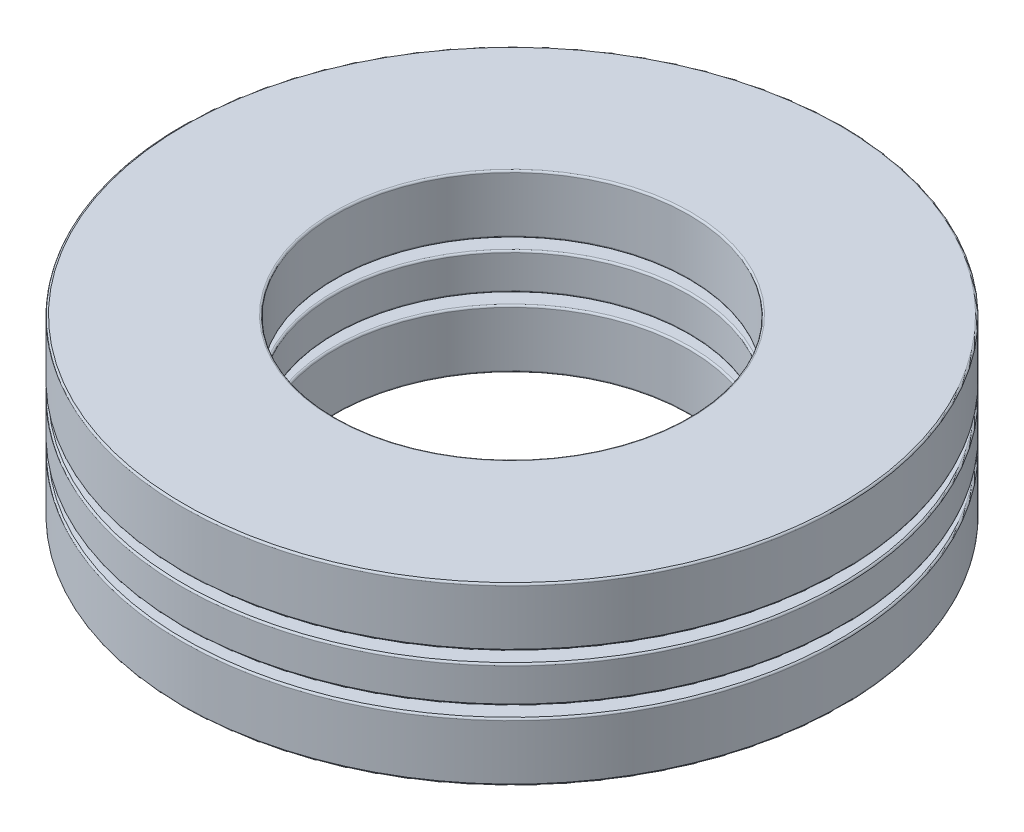
ISO-10303-21;
HEADER;
FILE_DESCRIPTION(('STEP AP214'),'2;1');
FILE_NAME('part.step','',(''),(''),'','','');
FILE_SCHEMA(('AUTOMOTIVE_DESIGN { 1 0 10303 214 1 1 1 1 }'));
ENDSEC;
DATA;
#1=APPLICATION_CONTEXT('core data for automotive mechanical design processes');
#2=APPLICATION_PROTOCOL_DEFINITION('international standard','automotive_design',2000,#1);
#3=PRODUCT_CONTEXT('',#1,'mechanical');
#4=PRODUCT('Part','Part','',(#3));
#5=PRODUCT_RELATED_PRODUCT_CATEGORY('part','',(#4));
#6=PRODUCT_DEFINITION_FORMATION('','',#4);
#7=PRODUCT_DEFINITION_CONTEXT('part definition',#1,'design');
#8=PRODUCT_DEFINITION('design','',#6,#7);
#9=PRODUCT_DEFINITION_SHAPE('','',#8);
#10=(LENGTH_UNIT() NAMED_UNIT(*) SI_UNIT(.MILLI.,.METRE.));
#11=(NAMED_UNIT(*) PLANE_ANGLE_UNIT() SI_UNIT($,.RADIAN.));
#12=(NAMED_UNIT(*) SI_UNIT($,.STERADIAN.) SOLID_ANGLE_UNIT());
#13=UNCERTAINTY_MEASURE_WITH_UNIT(LENGTH_MEASURE(1.E-05),#10,'distance_accuracy_value','');
#14=(GEOMETRIC_REPRESENTATION_CONTEXT(3) GLOBAL_UNCERTAINTY_ASSIGNED_CONTEXT((#13)) GLOBAL_UNIT_ASSIGNED_CONTEXT((#10,
#11,#12)) REPRESENTATION_CONTEXT('',''));
#15=CARTESIAN_POINT('',(0.,0.,0.));
#16=DIRECTION('',(0.,0.,1.));
#17=DIRECTION('',(1.,0.,0.));
#18=AXIS2_PLACEMENT_3D('',#15,#16,#17);
#19=CARTESIAN_POINT('',(0.,-3.1623,0.));
#20=DIRECTION('',(0.,-1.,0.));
#21=DIRECTION('',(0.,0.,-1.));
#22=AXIS2_PLACEMENT_3D('',#19,#20,#21);
#23=CYLINDRICAL_SURFACE('',#22,11.90625);
#24=CARTESIAN_POINT('',(0.,-3.099054,0.));
#25=DIRECTION('',(0.,1.,0.));
#26=DIRECTION('',(0.,0.,1.));
#27=AXIS2_PLACEMENT_3D('',#24,#25,#26);
#28=CIRCLE('',#27,11.90625);
#29=CARTESIAN_POINT('',(0.,-3.099054,11.90625));
#30=VERTEX_POINT('',#29);
#31=EDGE_CURVE('E11',#30,#30,#28,.T.);
#32=ORIENTED_EDGE('',*,*,#31,.T.);
#33=EDGE_LOOP('',(#32));
#34=FACE_BOUND('',#33,.T.);
#35=CARTESIAN_POINT('',(0.,-1.117346,0.));
#36=DIRECTION('',(0.,-1.,0.));
#37=DIRECTION('',(0.,0.,-1.));
#38=AXIS2_PLACEMENT_3D('',#35,#36,#37);
#39=CIRCLE('',#38,11.90625);
#40=CARTESIAN_POINT('',(0.,-1.117346,-11.90625));
#41=VERTEX_POINT('',#40);
#42=EDGE_CURVE('E58',#41,#41,#39,.T.);
#43=ORIENTED_EDGE('',*,*,#42,.T.);
#44=EDGE_LOOP('',(#43));
#45=FACE_BOUND('',#44,.T.);
#46=ADVANCED_FACE('F50',(#34,#45),#23,.T.);
#47=CARTESIAN_POINT('',(0.,-1.0541,11.90625));
#48=DIRECTION('',(0.,-1.,0.));
#49=DIRECTION('',(0.,0.,-1.));
#50=AXIS2_PLACEMENT_3D('',#47,#48,#49);
#51=PLANE('',#50);
#52=CARTESIAN_POINT('',(0.,-1.0541,0.));
#53=DIRECTION('',(0.,-1.,0.));
#54=DIRECTION('',(0.,0.,-1.));
#55=AXIS2_PLACEMENT_3D('',#52,#53,#54);
#56=CIRCLE('',#55,6.451346);
#57=CARTESIAN_POINT('',(0.,-1.0541,-6.451346));
#58=VERTEX_POINT('',#57);
#59=EDGE_CURVE('E63',#58,#58,#56,.T.);
#60=ORIENTED_EDGE('',*,*,#59,.T.);
#61=EDGE_LOOP('',(#60));
#62=FACE_BOUND('',#61,.T.);
#63=CARTESIAN_POINT('',(0.,-1.0541,0.));
#64=DIRECTION('',(0.,-1.,0.));
#65=DIRECTION('',(0.,0.,-1.));
#66=AXIS2_PLACEMENT_3D('',#63,#64,#65);
#67=CIRCLE('',#66,11.843004);
#68=CARTESIAN_POINT('',(0.,-1.0541,-11.843004));
#69=VERTEX_POINT('',#68);
#70=EDGE_CURVE('E68',#69,#69,#67,.F.);
#71=ORIENTED_EDGE('',*,*,#70,.T.);
#72=EDGE_LOOP('',(#71));
#73=FACE_BOUND('',#72,.T.);
#74=ADVANCED_FACE('F101',(#62,#73),#51,.F.);
#75=CARTESIAN_POINT('',(0.,-3.1623,0.));
#76=DIRECTION('',(0.,-1.,0.));
#77=DIRECTION('',(0.,0.,-1.));
#78=AXIS2_PLACEMENT_3D('',#75,#76,#77);
#79=CYLINDRICAL_SURFACE('',#78,6.3881);
#80=CARTESIAN_POINT('',(0.,-3.099054,0.));
#81=DIRECTION('',(0.,1.,0.));
#82=DIRECTION('',(0.,0.,1.));
#83=AXIS2_PLACEMENT_3D('',#80,#81,#82);
#84=CIRCLE('',#83,6.3881);
#85=CARTESIAN_POINT('',(0.,-3.099054,6.3881));
#86=VERTEX_POINT('',#85);
#87=EDGE_CURVE('E82',#86,#86,#84,.F.);
#88=ORIENTED_EDGE('',*,*,#87,.T.);
#89=EDGE_LOOP('',(#88));
#90=FACE_BOUND('',#89,.T.);
#91=CARTESIAN_POINT('',(0.,-1.117346,0.));
#92=DIRECTION('',(0.,-1.,0.));
#93=DIRECTION('',(0.,0.,-1.));
#94=AXIS2_PLACEMENT_3D('',#91,#92,#93);
#95=CIRCLE('',#94,6.3881);
#96=CARTESIAN_POINT('',(0.,-1.117346,-6.3881));
#97=VERTEX_POINT('',#96);
#98=EDGE_CURVE('E86',#97,#97,#95,.F.);
#99=ORIENTED_EDGE('',*,*,#98,.T.);
#100=EDGE_LOOP('',(#99));
#101=FACE_BOUND('',#100,.T.);
#102=ADVANCED_FACE('F91',(#90,#101),#79,.F.);
#103=CARTESIAN_POINT('',(0.,-3.1623,11.90625));
#104=DIRECTION('',(0.,1.,0.));
#105=DIRECTION('',(0.,0.,1.));
#106=AXIS2_PLACEMENT_3D('',#103,#104,#105);
#107=PLANE('',#106);
#108=CARTESIAN_POINT('',(0.,-3.1623,0.));
#109=DIRECTION('',(0.,1.,0.));
#110=DIRECTION('',(0.,0.,1.));
#111=AXIS2_PLACEMENT_3D('',#108,#109,#110);
#112=CIRCLE('',#111,6.451346);
#113=CARTESIAN_POINT('',(0.,-3.1623,6.451346));
#114=VERTEX_POINT('',#113);
#115=EDGE_CURVE('E74',#114,#114,#112,.T.);
#116=ORIENTED_EDGE('',*,*,#115,.T.);
#117=EDGE_LOOP('',(#116));
#118=FACE_BOUND('',#117,.T.);
#119=CARTESIAN_POINT('',(0.,-3.1623,0.));
#120=DIRECTION('',(0.,1.,0.));
#121=DIRECTION('',(0.,0.,1.));
#122=AXIS2_PLACEMENT_3D('',#119,#120,#121);
#123=CIRCLE('',#122,11.843004);
#124=CARTESIAN_POINT('',(0.,-3.1623,11.843004));
#125=VERTEX_POINT('',#124);
#126=EDGE_CURVE('E78',#125,#125,#123,.F.);
#127=ORIENTED_EDGE('',*,*,#126,.T.);
#128=EDGE_LOOP('',(#127));
#129=FACE_BOUND('',#128,.T.);
#130=ADVANCED_FACE('F120',(#118,#129),#107,.F.);
#131=CARTESIAN_POINT('',(0.,-3.099054,0.));
#132=DIRECTION('',(0.,1.,0.));
#133=DIRECTION('',(0.,0.,1.));
#134=AXIS2_PLACEMENT_3D('',#131,#132,#133);
#135=TOROIDAL_SURFACE('',#134,6.451346,0.063246);
#136=ORIENTED_EDGE('',*,*,#115,.F.);
#137=EDGE_LOOP('',(#136));
#138=FACE_BOUND('',#137,.T.);
#139=ORIENTED_EDGE('',*,*,#87,.F.);
#140=EDGE_LOOP('',(#139));
#141=FACE_BOUND('',#140,.T.);
#142=ADVANCED_FACE('F97',(#138,#141),#135,.T.);
#143=CARTESIAN_POINT('',(0.,-1.117346,0.));
#144=DIRECTION('',(0.,-1.,0.));
#145=DIRECTION('',(0.,0.,-1.));
#146=AXIS2_PLACEMENT_3D('',#143,#144,#145);
#147=TOROIDAL_SURFACE('',#146,6.451346,0.063246);
#148=ORIENTED_EDGE('',*,*,#98,.F.);
#149=EDGE_LOOP('',(#148));
#150=FACE_BOUND('',#149,.T.);
#151=ORIENTED_EDGE('',*,*,#59,.F.);
#152=EDGE_LOOP('',(#151));
#153=FACE_BOUND('',#152,.T.);
#154=ADVANCED_FACE('F93',(#150,#153),#147,.T.);
#155=CARTESIAN_POINT('',(0.,-3.099054,0.));
#156=DIRECTION('',(0.,1.,0.));
#157=DIRECTION('',(0.,0.,1.));
#158=AXIS2_PLACEMENT_3D('',#155,#156,#157);
#159=TOROIDAL_SURFACE('',#158,11.843004,0.063246);
#160=ORIENTED_EDGE('',*,*,#31,.F.);
#161=EDGE_LOOP('',(#160));
#162=FACE_BOUND('',#161,.T.);
#163=ORIENTED_EDGE('',*,*,#126,.F.);
#164=EDGE_LOOP('',(#163));
#165=FACE_BOUND('',#164,.T.);
#166=ADVANCED_FACE('F96',(#162,#165),#159,.T.);
#167=CARTESIAN_POINT('',(0.,-1.117346,0.));
#168=DIRECTION('',(0.,-1.,0.));
#169=DIRECTION('',(0.,0.,-1.));
#170=AXIS2_PLACEMENT_3D('',#167,#168,#169);
#171=TOROIDAL_SURFACE('',#170,11.843004,0.063246);
#172=ORIENTED_EDGE('',*,*,#70,.F.);
#173=EDGE_LOOP('',(#172));
#174=FACE_BOUND('',#173,.T.);
#175=ORIENTED_EDGE('',*,*,#42,.F.);
#176=EDGE_LOOP('',(#175));
#177=FACE_BOUND('',#176,.T.);
#178=ADVANCED_FACE('F52',(#174,#177),#171,.T.);
#179=CLOSED_SHELL('',(#46,#74,#102,#130,#142,#154,#166,#178));
#180=MANIFOLD_SOLID_BREP('B2',#179);
#181=CARTESIAN_POINT('',(0.,-3.1623,0.));
#182=DIRECTION('',(0.,-1.,0.));
#183=DIRECTION('',(0.,0.,-1.));
#184=AXIS2_PLACEMENT_3D('',#181,#182,#183);
#185=CYLINDRICAL_SURFACE('',#184,11.90625);
#186=CARTESIAN_POINT('',(0.,1.117346,0.));
#187=DIRECTION('',(0.,1.,0.));
#188=DIRECTION('',(0.,0.,1.));
#189=AXIS2_PLACEMENT_3D('',#186,#187,#188);
#190=CIRCLE('',#189,11.90625);
#191=CARTESIAN_POINT('',(0.,1.117346,11.90625));
#192=VERTEX_POINT('',#191);
#193=EDGE_CURVE('E49',#192,#192,#190,.T.);
#194=ORIENTED_EDGE('',*,*,#193,.T.);
#195=EDGE_LOOP('',(#194));
#196=FACE_BOUND('',#195,.T.);
#197=CARTESIAN_POINT('',(0.,3.099054,0.));
#198=DIRECTION('',(0.,-1.,0.));
#199=DIRECTION('',(0.,0.,-1.));
#200=AXIS2_PLACEMENT_3D('',#197,#198,#199);
#201=CIRCLE('',#200,11.90625);
#202=CARTESIAN_POINT('',(0.,3.099054,-11.90625));
#203=VERTEX_POINT('',#202);
#204=EDGE_CURVE('E177',#203,#203,#201,.T.);
#205=ORIENTED_EDGE('',*,*,#204,.T.);
#206=EDGE_LOOP('',(#205));
#207=FACE_BOUND('',#206,.T.);
#208=ADVANCED_FACE('F170',(#196,#207),#185,.T.);
#209=CARTESIAN_POINT('',(0.,3.1623,11.90625));
#210=DIRECTION('',(0.,-1.,0.));
#211=DIRECTION('',(0.,0.,-1.));
#212=AXIS2_PLACEMENT_3D('',#209,#210,#211);
#213=PLANE('',#212);
#214=CARTESIAN_POINT('',(0.,3.1623,0.));
#215=DIRECTION('',(0.,-1.,0.));
#216=DIRECTION('',(0.,0.,-1.));
#217=AXIS2_PLACEMENT_3D('',#214,#215,#216);
#218=CIRCLE('',#217,6.451346);
#219=CARTESIAN_POINT('',(0.,3.1623,-6.451346));
#220=VERTEX_POINT('',#219);
#221=EDGE_CURVE('E181',#220,#220,#218,.T.);
#222=ORIENTED_EDGE('',*,*,#221,.T.);
#223=EDGE_LOOP('',(#222));
#224=FACE_BOUND('',#223,.T.);
#225=CARTESIAN_POINT('',(0.,3.1623,0.));
#226=DIRECTION('',(0.,-1.,0.));
#227=DIRECTION('',(0.,0.,-1.));
#228=AXIS2_PLACEMENT_3D('',#225,#226,#227);
#229=CIRCLE('',#228,11.843004);
#230=CARTESIAN_POINT('',(0.,3.1623,-11.843004));
#231=VERTEX_POINT('',#230);
#232=EDGE_CURVE('E185',#231,#231,#229,.F.);
#233=ORIENTED_EDGE('',*,*,#232,.T.);
#234=EDGE_LOOP('',(#233));
#235=FACE_BOUND('',#234,.T.);
#236=ADVANCED_FACE('F213',(#224,#235),#213,.F.);
#237=CARTESIAN_POINT('',(0.,-3.1623,0.));
#238=DIRECTION('',(0.,-1.,0.));
#239=DIRECTION('',(0.,0.,-1.));
#240=AXIS2_PLACEMENT_3D('',#237,#238,#239);
#241=CYLINDRICAL_SURFACE('',#240,6.3881);
#242=CARTESIAN_POINT('',(0.,1.117346,0.));
#243=DIRECTION('',(0.,1.,0.));
#244=DIRECTION('',(0.,0.,1.));
#245=AXIS2_PLACEMENT_3D('',#242,#243,#244);
#246=CIRCLE('',#245,6.3881);
#247=CARTESIAN_POINT('',(0.,1.117346,6.3881));
#248=VERTEX_POINT('',#247);
#249=EDGE_CURVE('E196',#248,#248,#246,.F.);
#250=ORIENTED_EDGE('',*,*,#249,.T.);
#251=EDGE_LOOP('',(#250));
#252=FACE_BOUND('',#251,.T.);
#253=CARTESIAN_POINT('',(0.,3.099054,0.));
#254=DIRECTION('',(0.,-1.,0.));
#255=DIRECTION('',(0.,0.,-1.));
#256=AXIS2_PLACEMENT_3D('',#253,#254,#255);
#257=CIRCLE('',#256,6.3881);
#258=CARTESIAN_POINT('',(0.,3.099054,-6.3881));
#259=VERTEX_POINT('',#258);
#260=EDGE_CURVE('E199',#259,#259,#257,.F.);
#261=ORIENTED_EDGE('',*,*,#260,.T.);
#262=EDGE_LOOP('',(#261));
#263=FACE_BOUND('',#262,.T.);
#264=ADVANCED_FACE('F203',(#252,#263),#241,.F.);
#265=CARTESIAN_POINT('',(0.,1.0541,11.90625));
#266=DIRECTION('',(0.,1.,0.));
#267=DIRECTION('',(0.,0.,1.));
#268=AXIS2_PLACEMENT_3D('',#265,#266,#267);
#269=PLANE('',#268);
#270=CARTESIAN_POINT('',(0.,1.0541,0.));
#271=DIRECTION('',(0.,1.,0.));
#272=DIRECTION('',(0.,0.,1.));
#273=AXIS2_PLACEMENT_3D('',#270,#271,#272);
#274=CIRCLE('',#273,6.451346);
#275=CARTESIAN_POINT('',(0.,1.0541,6.451346));
#276=VERTEX_POINT('',#275);
#277=EDGE_CURVE('E190',#276,#276,#274,.T.);
#278=ORIENTED_EDGE('',*,*,#277,.T.);
#279=EDGE_LOOP('',(#278));
#280=FACE_BOUND('',#279,.T.);
#281=CARTESIAN_POINT('',(0.,1.0541,0.));
#282=DIRECTION('',(0.,1.,0.));
#283=DIRECTION('',(0.,0.,1.));
#284=AXIS2_PLACEMENT_3D('',#281,#282,#283);
#285=CIRCLE('',#284,11.843004);
#286=CARTESIAN_POINT('',(0.,1.0541,11.843004));
#287=VERTEX_POINT('',#286);
#288=EDGE_CURVE('E193',#287,#287,#285,.F.);
#289=ORIENTED_EDGE('',*,*,#288,.T.);
#290=EDGE_LOOP('',(#289));
#291=FACE_BOUND('',#290,.T.);
#292=ADVANCED_FACE('F232',(#280,#291),#269,.F.);
#293=CARTESIAN_POINT('',(0.,1.117346,0.));
#294=DIRECTION('',(0.,1.,0.));
#295=DIRECTION('',(0.,0.,1.));
#296=AXIS2_PLACEMENT_3D('',#293,#294,#295);
#297=TOROIDAL_SURFACE('',#296,6.451346,0.063246);
#298=ORIENTED_EDGE('',*,*,#277,.F.);
#299=EDGE_LOOP('',(#298));
#300=FACE_BOUND('',#299,.T.);
#301=ORIENTED_EDGE('',*,*,#249,.F.);
#302=EDGE_LOOP('',(#301));
#303=FACE_BOUND('',#302,.T.);
#304=ADVANCED_FACE('F209',(#300,#303),#297,.T.);
#305=CARTESIAN_POINT('',(0.,3.099054,0.));
#306=DIRECTION('',(0.,-1.,0.));
#307=DIRECTION('',(0.,0.,-1.));
#308=AXIS2_PLACEMENT_3D('',#305,#306,#307);
#309=TOROIDAL_SURFACE('',#308,6.451346,0.063246);
#310=ORIENTED_EDGE('',*,*,#260,.F.);
#311=EDGE_LOOP('',(#310));
#312=FACE_BOUND('',#311,.T.);
#313=ORIENTED_EDGE('',*,*,#221,.F.);
#314=EDGE_LOOP('',(#313));
#315=FACE_BOUND('',#314,.T.);
#316=ADVANCED_FACE('F205',(#312,#315),#309,.T.);
#317=CARTESIAN_POINT('',(0.,1.117346,0.));
#318=DIRECTION('',(0.,1.,0.));
#319=DIRECTION('',(0.,0.,1.));
#320=AXIS2_PLACEMENT_3D('',#317,#318,#319);
#321=TOROIDAL_SURFACE('',#320,11.843004,0.063246);
#322=ORIENTED_EDGE('',*,*,#193,.F.);
#323=EDGE_LOOP('',(#322));
#324=FACE_BOUND('',#323,.T.);
#325=ORIENTED_EDGE('',*,*,#288,.F.);
#326=EDGE_LOOP('',(#325));
#327=FACE_BOUND('',#326,.T.);
#328=ADVANCED_FACE('F208',(#324,#327),#321,.T.);
#329=CARTESIAN_POINT('',(0.,3.099054,0.));
#330=DIRECTION('',(0.,-1.,0.));
#331=DIRECTION('',(0.,0.,-1.));
#332=AXIS2_PLACEMENT_3D('',#329,#330,#331);
#333=TOROIDAL_SURFACE('',#332,11.843004,0.063246);
#334=ORIENTED_EDGE('',*,*,#232,.F.);
#335=EDGE_LOOP('',(#334));
#336=FACE_BOUND('',#335,.T.);
#337=ORIENTED_EDGE('',*,*,#204,.F.);
#338=EDGE_LOOP('',(#337));
#339=FACE_BOUND('',#338,.T.);
#340=ADVANCED_FACE('F172',(#336,#339),#333,.T.);
#341=CLOSED_SHELL('',(#208,#236,#264,#292,#304,#316,#328,#340));
#342=MANIFOLD_SOLID_BREP('B6',#341);
#343=CARTESIAN_POINT('',(-8.69948038944209,0.,2.82663252552176));
#344=DIRECTION('',(0.,1.,0.));
#345=DIRECTION('',(0.95105651629515,0.,-0.309016994374958));
#346=AXIS2_PLACEMENT_3D('',#343,#344,#345);
#347=SPHERICAL_SURFACE('',#346,1.0541);
#348=CARTESIAN_POINT('',(-8.69948038944209,1.0541,2.82663252552176));
#349=VERTEX_POINT('',#348);
#350=VERTEX_LOOP('',#349);
#351=FACE_BOUND('',#350,.T.);
#352=ADVANCED_FACE('F282',(#351),#347,.T.);
#353=CLOSED_SHELL('',(#352));
#354=MANIFOLD_SOLID_BREP('B44',#353);
#355=CARTESIAN_POINT('',(-5.37657456513847,0.,-7.40022002552161));
#356=DIRECTION('',(0.,1.,0.));
#357=DIRECTION('',(0.58778525229248,0.,0.809016994374942));
#358=AXIS2_PLACEMENT_3D('',#355,#356,#357);
#359=SPHERICAL_SURFACE('',#358,1.0541);
#360=CARTESIAN_POINT('',(-5.37657456513847,1.0541,-7.40022002552161));
#361=VERTEX_POINT('',#360);
#362=VERTEX_LOOP('',#361);
#363=FACE_BOUND('',#362,.T.);
#364=ADVANCED_FACE('F299',(#363),#359,.T.);
#365=CLOSED_SHELL('',(#364));
#366=MANIFOLD_SOLID_BREP('B166',#365);
#367=CARTESIAN_POINT('',(5.37657456513836,0.,-7.40022002552169));
#368=DIRECTION('',(0.,1.,0.));
#369=DIRECTION('',(-0.587785252292469,0.,0.809016994374951));
#370=AXIS2_PLACEMENT_3D('',#367,#368,#369);
#371=SPHERICAL_SURFACE('',#370,1.0541);
#372=CARTESIAN_POINT('',(5.37657456513836,1.0541,-7.40022002552169));
#373=VERTEX_POINT('',#372);
#374=VERTEX_LOOP('',#373);
#375=FACE_BOUND('',#374,.T.);
#376=ADVANCED_FACE('F316',(#375),#371,.T.);
#377=CLOSED_SHELL('',(#376));
#378=MANIFOLD_SOLID_BREP('B278',#377);
#379=CARTESIAN_POINT('',(8.69948038944213,0.,2.82663252552164));
#380=DIRECTION('',(0.,1.,0.));
#381=DIRECTION('',(-0.951056516295155,0.,-0.309016994374945));
#382=AXIS2_PLACEMENT_3D('',#379,#380,#381);
#383=SPHERICAL_SURFACE('',#382,1.0541);
#384=CARTESIAN_POINT('',(8.69948038944213,1.0541,2.82663252552164));
#385=VERTEX_POINT('',#384);
#386=VERTEX_LOOP('',#385);
#387=FACE_BOUND('',#386,.T.);
#388=ADVANCED_FACE('F333',(#387),#383,.T.);
#389=CLOSED_SHELL('',(#388));
#390=MANIFOLD_SOLID_BREP('B295',#389);
#391=CARTESIAN_POINT('',(0.,0.,9.147175));
#392=DIRECTION('',(0.,1.,0.));
#393=DIRECTION('',(0.,0.,-1.));
#394=AXIS2_PLACEMENT_3D('',#391,#392,#393);
#395=SPHERICAL_SURFACE('',#394,1.0541);
#396=CARTESIAN_POINT('',(0.,1.0541,9.147175));
#397=VERTEX_POINT('',#396);
#398=VERTEX_LOOP('',#397);
#399=FACE_BOUND('',#398,.T.);
#400=ADVANCED_FACE('F351',(#399),#395,.T.);
#401=CLOSED_SHELL('',(#400));
#402=MANIFOLD_SOLID_BREP('B312',#401);
#403=CARTESIAN_POINT('',(0.,-3.1623,0.));
#404=DIRECTION('',(0.,-1.,0.));
#405=DIRECTION('',(0.,0.,-1.));
#406=AXIS2_PLACEMENT_3D('',#403,#404,#405);
#407=CYLINDRICAL_SURFACE('',#406,11.90625);
#408=CARTESIAN_POINT('',(0.,-0.595566500000002,0.));
#409=DIRECTION('',(0.,1.,0.));
#410=DIRECTION('',(0.,0.,1.));
#411=AXIS2_PLACEMENT_3D('',#408,#409,#410);
#412=CIRCLE('',#411,11.90625);
#413=CARTESIAN_POINT('',(0.,-0.595566500000002,11.90625));
#414=VERTEX_POINT('',#413);
#415=EDGE_CURVE('E350',#414,#414,#412,.T.);
#416=ORIENTED_EDGE('',*,*,#415,.T.);
#417=EDGE_LOOP('',(#416));
#418=FACE_BOUND('',#417,.T.);
#419=CARTESIAN_POINT('',(0.,0.595566499999998,0.));
#420=DIRECTION('',(0.,-1.,0.));
#421=DIRECTION('',(0.,0.,-1.));
#422=AXIS2_PLACEMENT_3D('',#419,#420,#421);
#423=CIRCLE('',#422,11.90625);
#424=CARTESIAN_POINT('',(0.,0.595566499999998,-11.90625));
#425=VERTEX_POINT('',#424);
#426=EDGE_CURVE('E369',#425,#425,#423,.T.);
#427=ORIENTED_EDGE('',*,*,#426,.T.);
#428=EDGE_LOOP('',(#427));
#429=FACE_BOUND('',#428,.T.);
#430=ADVANCED_FACE('F362',(#418,#429),#407,.T.);
#431=CARTESIAN_POINT('',(0.,-0.658812500000002,11.90625));
#432=DIRECTION('',(0.,1.,0.));
#433=DIRECTION('',(0.,0.,1.));
#434=AXIS2_PLACEMENT_3D('',#431,#432,#433);
#435=PLANE('',#434);
#436=CARTESIAN_POINT('',(0.,-0.658812500000002,0.));
#437=DIRECTION('',(0.,1.,0.));
#438=DIRECTION('',(0.,0.,1.));
#439=AXIS2_PLACEMENT_3D('',#436,#437,#438);
#440=CIRCLE('',#439,6.451346);
#441=CARTESIAN_POINT('',(0.,-0.658812500000002,6.451346));
#442=VERTEX_POINT('',#441);
#443=EDGE_CURVE('E382',#442,#442,#440,.T.);
#444=ORIENTED_EDGE('',*,*,#443,.T.);
#445=EDGE_LOOP('',(#444));
#446=FACE_BOUND('',#445,.T.);
#447=CARTESIAN_POINT('',(0.,-0.658812500000002,0.));
#448=DIRECTION('',(0.,1.,0.));
#449=DIRECTION('',(0.,0.,1.));
#450=AXIS2_PLACEMENT_3D('',#447,#448,#449);
#451=CIRCLE('',#450,11.843004);
#452=CARTESIAN_POINT('',(0.,-0.658812500000002,11.843004));
#453=VERTEX_POINT('',#452);
#454=EDGE_CURVE('E385',#453,#453,#451,.F.);
#455=ORIENTED_EDGE('',*,*,#454,.T.);
#456=EDGE_LOOP('',(#455));
#457=FACE_BOUND('',#456,.T.);
#458=CARTESIAN_POINT('',(-8.69948038944209,-0.658812500000002,2.82663252552176));
#459=DIRECTION('',(0.,1.,0.));
#460=DIRECTION('',(-0.95105651629515,0.,0.309016994374958));
#461=AXIS2_PLACEMENT_3D('',#458,#459,#460);
#462=CIRCLE('',#461,0.822856548763967);
#463=CARTESIAN_POINT('',(-9.4820634721202,-0.658812500000002,3.08090918302255));
#464=VERTEX_POINT('',#463);
#465=EDGE_CURVE('E418',#464,#464,#462,.T.);
#466=ORIENTED_EDGE('',*,*,#465,.T.);
#467=EDGE_LOOP('',(#466));
#468=FACE_BOUND('',#467,.T.);
#469=CARTESIAN_POINT('',(-5.37657456513847,-0.658812500000002,-7.40022002552161));
#470=DIRECTION('',(0.,1.,0.));
#471=DIRECTION('',(-0.58778525229248,0.,-0.809016994374942));
#472=AXIS2_PLACEMENT_3D('',#469,#470,#471);
#473=CIRCLE('',#472,0.822856548763967);
#474=CARTESIAN_POINT('',(-5.86023750925422,-0.658812500000002,-8.06592495740438));
#475=VERTEX_POINT('',#474);
#476=EDGE_CURVE('E412',#475,#475,#473,.T.);
#477=ORIENTED_EDGE('',*,*,#476,.T.);
#478=EDGE_LOOP('',(#477));
#479=FACE_BOUND('',#478,.T.);
#480=CARTESIAN_POINT('',(5.37657456513836,-0.658812500000002,-7.40022002552169));
#481=DIRECTION('',(0.,1.,0.));
#482=DIRECTION('',(0.587785252292469,0.,-0.809016994374951));
#483=AXIS2_PLACEMENT_3D('',#480,#481,#482);
#484=CIRCLE('',#483,0.822856548763967);
#485=CARTESIAN_POINT('',(5.8602375092541,-0.658812500000002,-8.06592495740446));
#486=VERTEX_POINT('',#485);
#487=EDGE_CURVE('E406',#486,#486,#484,.T.);
#488=ORIENTED_EDGE('',*,*,#487,.T.);
#489=EDGE_LOOP('',(#488));
#490=FACE_BOUND('',#489,.T.);
#491=CARTESIAN_POINT('',(8.69948038944213,-0.658812500000002,2.82663252552164));
#492=DIRECTION('',(0.,1.,0.));
#493=DIRECTION('',(0.951056516295155,0.,0.309016994374945));
#494=AXIS2_PLACEMENT_3D('',#491,#492,#493);
#495=CIRCLE('',#494,0.822856548763967);
#496=CARTESIAN_POINT('',(9.48206347212025,-0.658812500000002,3.08090918302242));
#497=VERTEX_POINT('',#496);
#498=EDGE_CURVE('E398',#497,#497,#495,.T.);
#499=ORIENTED_EDGE('',*,*,#498,.T.);
#500=EDGE_LOOP('',(#499));
#501=FACE_BOUND('',#500,.T.);
#502=CARTESIAN_POINT('',(0.,-0.658812500000002,9.147175));
#503=DIRECTION('',(0.,1.,0.));
#504=DIRECTION('',(0.,0.,1.));
#505=AXIS2_PLACEMENT_3D('',#502,#503,#504);
#506=CIRCLE('',#505,0.822856548763967);
#507=CARTESIAN_POINT('',(0.,-0.658812500000002,9.97003154876397));
#508=VERTEX_POINT('',#507);
#509=EDGE_CURVE('E394',#508,#508,#506,.T.);
#510=ORIENTED_EDGE('',*,*,#509,.T.);
#511=EDGE_LOOP('',(#510));
#512=FACE_BOUND('',#511,.T.);
#513=ADVANCED_FACE('F436',(#446,#457,#468,#479,#490,#501,#512),#435,.F.);
#514=CARTESIAN_POINT('',(0.,-3.1623,0.));
#515=DIRECTION('',(0.,-1.,0.));
#516=DIRECTION('',(0.,0.,-1.));
#517=AXIS2_PLACEMENT_3D('',#514,#515,#516);
#518=CYLINDRICAL_SURFACE('',#517,6.3881);
#519=CARTESIAN_POINT('',(0.,-0.595566500000002,0.));
#520=DIRECTION('',(0.,1.,0.));
#521=DIRECTION('',(0.,0.,1.));
#522=AXIS2_PLACEMENT_3D('',#519,#520,#521);
#523=CIRCLE('',#522,6.3881);
#524=CARTESIAN_POINT('',(0.,-0.595566500000002,6.3881));
#525=VERTEX_POINT('',#524);
#526=EDGE_CURVE('E388',#525,#525,#523,.F.);
#527=ORIENTED_EDGE('',*,*,#526,.T.);
#528=EDGE_LOOP('',(#527));
#529=FACE_BOUND('',#528,.T.);
#530=CARTESIAN_POINT('',(0.,0.595566499999998,0.));
#531=DIRECTION('',(0.,-1.,0.));
#532=DIRECTION('',(0.,0.,-1.));
#533=AXIS2_PLACEMENT_3D('',#530,#531,#532);
#534=CIRCLE('',#533,6.3881);
#535=CARTESIAN_POINT('',(0.,0.595566499999998,-6.3881));
#536=VERTEX_POINT('',#535);
#537=EDGE_CURVE('E391',#536,#536,#534,.F.);
#538=ORIENTED_EDGE('',*,*,#537,.T.);
#539=EDGE_LOOP('',(#538));
#540=FACE_BOUND('',#539,.T.);
#541=ADVANCED_FACE('F439',(#529,#540),#518,.F.);
#542=CARTESIAN_POINT('',(0.,0.658812499999997,11.90625));
#543=DIRECTION('',(0.,-1.,0.));
#544=DIRECTION('',(0.,0.,-1.));
#545=AXIS2_PLACEMENT_3D('',#542,#543,#544);
#546=PLANE('',#545);
#547=CARTESIAN_POINT('',(0.,0.658812499999997,0.));
#548=DIRECTION('',(0.,-1.,0.));
#549=DIRECTION('',(0.,0.,-1.));
#550=AXIS2_PLACEMENT_3D('',#547,#548,#549);
#551=CIRCLE('',#550,6.451346);
#552=CARTESIAN_POINT('',(0.,0.658812499999997,-6.451346));
#553=VERTEX_POINT('',#552);
#554=EDGE_CURVE('E373',#553,#553,#551,.T.);
#555=ORIENTED_EDGE('',*,*,#554,.T.);
#556=EDGE_LOOP('',(#555));
#557=FACE_BOUND('',#556,.T.);
#558=CARTESIAN_POINT('',(0.,0.658812499999997,0.));
#559=DIRECTION('',(0.,-1.,0.));
#560=DIRECTION('',(0.,0.,-1.));
#561=AXIS2_PLACEMENT_3D('',#558,#559,#560);
#562=CIRCLE('',#561,11.843004);
#563=CARTESIAN_POINT('',(0.,0.658812499999997,-11.843004));
#564=VERTEX_POINT('',#563);
#565=EDGE_CURVE('E377',#564,#564,#562,.F.);
#566=ORIENTED_EDGE('',*,*,#565,.T.);
#567=EDGE_LOOP('',(#566));
#568=FACE_BOUND('',#567,.T.);
#569=CARTESIAN_POINT('',(-8.69948038944209,0.658812499999997,2.82663252552176));
#570=DIRECTION('',(0.,-1.,0.));
#571=DIRECTION('',(0.95105651629515,0.,-0.309016994374958));
#572=AXIS2_PLACEMENT_3D('',#569,#570,#571);
#573=CIRCLE('',#572,0.822856548763971);
#574=CARTESIAN_POINT('',(-7.91689730676398,0.658812499999997,2.57235586802096));
#575=VERTEX_POINT('',#574);
#576=EDGE_CURVE('E421',#575,#575,#573,.T.);
#577=ORIENTED_EDGE('',*,*,#576,.T.);
#578=EDGE_LOOP('',(#577));
#579=FACE_BOUND('',#578,.T.);
#580=CARTESIAN_POINT('',(-5.37657456513847,0.658812499999997,-7.40022002552161));
#581=DIRECTION('',(0.,-1.,0.));
#582=DIRECTION('',(0.58778525229248,0.,0.809016994374942));
#583=AXIS2_PLACEMENT_3D('',#580,#581,#582);
#584=CIRCLE('',#583,0.822856548763971);
#585=CARTESIAN_POINT('',(-4.89291162102272,0.658812499999997,-6.73451509363885));
#586=VERTEX_POINT('',#585);
#587=EDGE_CURVE('E415',#586,#586,#584,.T.);
#588=ORIENTED_EDGE('',*,*,#587,.T.);
#589=EDGE_LOOP('',(#588));
#590=FACE_BOUND('',#589,.T.);
#591=CARTESIAN_POINT('',(5.37657456513836,0.658812499999997,-7.40022002552169));
#592=DIRECTION('',(0.,-1.,0.));
#593=DIRECTION('',(-0.587785252292469,0.,0.809016994374951));
#594=AXIS2_PLACEMENT_3D('',#591,#592,#593);
#595=CIRCLE('',#594,0.822856548763971);
#596=CARTESIAN_POINT('',(4.89291162102262,0.658812499999997,-6.73451509363892));
#597=VERTEX_POINT('',#596);
#598=EDGE_CURVE('E409',#597,#597,#595,.T.);
#599=ORIENTED_EDGE('',*,*,#598,.T.);
#600=EDGE_LOOP('',(#599));
#601=FACE_BOUND('',#600,.T.);
#602=CARTESIAN_POINT('',(8.69948038944213,0.658812499999997,2.82663252552164));
#603=DIRECTION('',(0.,-1.,0.));
#604=DIRECTION('',(-0.951056516295155,0.,-0.309016994374945));
#605=AXIS2_PLACEMENT_3D('',#602,#603,#604);
#606=CIRCLE('',#605,0.822856548763971);
#607=CARTESIAN_POINT('',(7.91689730676402,0.658812499999997,2.57235586802085));
#608=VERTEX_POINT('',#607);
#609=EDGE_CURVE('E403',#608,#608,#606,.T.);
#610=ORIENTED_EDGE('',*,*,#609,.T.);
#611=EDGE_LOOP('',(#610));
#612=FACE_BOUND('',#611,.T.);
#613=CARTESIAN_POINT('',(0.,0.658812499999997,9.147175));
#614=DIRECTION('',(0.,-1.,0.));
#615=DIRECTION('',(0.,0.,-1.));
#616=AXIS2_PLACEMENT_3D('',#613,#614,#615);
#617=CIRCLE('',#616,0.822856548763971);
#618=CARTESIAN_POINT('',(0.,0.658812499999997,8.32431845123603));
#619=VERTEX_POINT('',#618);
#620=EDGE_CURVE('E395',#619,#619,#617,.T.);
#621=ORIENTED_EDGE('',*,*,#620,.T.);
#622=EDGE_LOOP('',(#621));
#623=FACE_BOUND('',#622,.T.);
#624=ADVANCED_FACE('F425',(#557,#568,#579,#590,#601,#612,#623),#546,.F.);
#625=CARTESIAN_POINT('',(0.,0.,9.147175));
#626=DIRECTION('',(0.,1.,0.));
#627=DIRECTION('',(0.,0.,-1.));
#628=AXIS2_PLACEMENT_3D('',#625,#626,#627);
#629=SPHERICAL_SURFACE('',#628,1.0541);
#630=ORIENTED_EDGE('',*,*,#620,.F.);
#631=EDGE_LOOP('',(#630));
#632=FACE_BOUND('',#631,.T.);
#633=ORIENTED_EDGE('',*,*,#509,.F.);
#634=EDGE_LOOP('',(#633));
#635=FACE_BOUND('',#634,.T.);
#636=ADVANCED_FACE('F450',(#632,#635),#629,.F.);
#637=CARTESIAN_POINT('',(8.69948038944213,0.,2.82663252552164));
#638=DIRECTION('',(0.,1.,0.));
#639=DIRECTION('',(-0.951056516295155,0.,-0.309016994374945));
#640=AXIS2_PLACEMENT_3D('',#637,#638,#639);
#641=SPHERICAL_SURFACE('',#640,1.0541);
#642=ORIENTED_EDGE('',*,*,#609,.F.);
#643=EDGE_LOOP('',(#642));
#644=FACE_BOUND('',#643,.T.);
#645=ORIENTED_EDGE('',*,*,#498,.F.);
#646=EDGE_LOOP('',(#645));
#647=FACE_BOUND('',#646,.T.);
#648=ADVANCED_FACE('F452',(#644,#647),#641,.F.);
#649=CARTESIAN_POINT('',(5.37657456513836,0.,-7.40022002552169));
#650=DIRECTION('',(0.,1.,0.));
#651=DIRECTION('',(-0.587785252292469,0.,0.809016994374951));
#652=AXIS2_PLACEMENT_3D('',#649,#650,#651);
#653=SPHERICAL_SURFACE('',#652,1.0541);
#654=ORIENTED_EDGE('',*,*,#598,.F.);
#655=EDGE_LOOP('',(#654));
#656=FACE_BOUND('',#655,.T.);
#657=ORIENTED_EDGE('',*,*,#487,.F.);
#658=EDGE_LOOP('',(#657));
#659=FACE_BOUND('',#658,.T.);
#660=ADVANCED_FACE('F458',(#656,#659),#653,.F.);
#661=CARTESIAN_POINT('',(-5.37657456513847,0.,-7.40022002552161));
#662=DIRECTION('',(0.,1.,0.));
#663=DIRECTION('',(0.58778525229248,0.,0.809016994374942));
#664=AXIS2_PLACEMENT_3D('',#661,#662,#663);
#665=SPHERICAL_SURFACE('',#664,1.0541);
#666=ORIENTED_EDGE('',*,*,#587,.F.);
#667=EDGE_LOOP('',(#666));
#668=FACE_BOUND('',#667,.T.);
#669=ORIENTED_EDGE('',*,*,#476,.F.);
#670=EDGE_LOOP('',(#669));
#671=FACE_BOUND('',#670,.T.);
#672=ADVANCED_FACE('F432',(#668,#671),#665,.F.);
#673=CARTESIAN_POINT('',(-8.69948038944209,0.,2.82663252552176));
#674=DIRECTION('',(0.,1.,0.));
#675=DIRECTION('',(0.95105651629515,0.,-0.309016994374958));
#676=AXIS2_PLACEMENT_3D('',#673,#674,#675);
#677=SPHERICAL_SURFACE('',#676,1.0541);
#678=ORIENTED_EDGE('',*,*,#576,.F.);
#679=EDGE_LOOP('',(#678));
#680=FACE_BOUND('',#679,.T.);
#681=ORIENTED_EDGE('',*,*,#465,.F.);
#682=EDGE_LOOP('',(#681));
#683=FACE_BOUND('',#682,.T.);
#684=ADVANCED_FACE('F428',(#680,#683),#677,.F.);
#685=CARTESIAN_POINT('',(0.,-0.595566500000002,0.));
#686=DIRECTION('',(0.,1.,0.));
#687=DIRECTION('',(0.,0.,1.));
#688=AXIS2_PLACEMENT_3D('',#685,#686,#687);
#689=TOROIDAL_SURFACE('',#688,6.451346,0.063246);
#690=ORIENTED_EDGE('',*,*,#443,.F.);
#691=EDGE_LOOP('',(#690));
#692=FACE_BOUND('',#691,.T.);
#693=ORIENTED_EDGE('',*,*,#526,.F.);
#694=EDGE_LOOP('',(#693));
#695=FACE_BOUND('',#694,.T.);
#696=ADVANCED_FACE('F431',(#692,#695),#689,.T.);
#697=CARTESIAN_POINT('',(0.,0.595566499999998,0.));
#698=DIRECTION('',(0.,-1.,0.));
#699=DIRECTION('',(0.,0.,-1.));
#700=AXIS2_PLACEMENT_3D('',#697,#698,#699);
#701=TOROIDAL_SURFACE('',#700,6.451346,0.063246);
#702=ORIENTED_EDGE('',*,*,#537,.F.);
#703=EDGE_LOOP('',(#702));
#704=FACE_BOUND('',#703,.T.);
#705=ORIENTED_EDGE('',*,*,#554,.F.);
#706=EDGE_LOOP('',(#705));
#707=FACE_BOUND('',#706,.T.);
#708=ADVANCED_FACE('F473',(#704,#707),#701,.T.);
#709=CARTESIAN_POINT('',(0.,-0.595566500000002,0.));
#710=DIRECTION('',(0.,1.,0.));
#711=DIRECTION('',(0.,0.,1.));
#712=AXIS2_PLACEMENT_3D('',#709,#710,#711);
#713=TOROIDAL_SURFACE('',#712,11.843004,0.063246);
#714=ORIENTED_EDGE('',*,*,#415,.F.);
#715=EDGE_LOOP('',(#714));
#716=FACE_BOUND('',#715,.T.);
#717=ORIENTED_EDGE('',*,*,#454,.F.);
#718=EDGE_LOOP('',(#717));
#719=FACE_BOUND('',#718,.T.);
#720=ADVANCED_FACE('F476',(#716,#719),#713,.T.);
#721=CARTESIAN_POINT('',(0.,0.595566499999998,0.));
#722=DIRECTION('',(0.,-1.,0.));
#723=DIRECTION('',(0.,0.,-1.));
#724=AXIS2_PLACEMENT_3D('',#721,#722,#723);
#725=TOROIDAL_SURFACE('',#724,11.843004,0.063246);
#726=ORIENTED_EDGE('',*,*,#565,.F.);
#727=EDGE_LOOP('',(#726));
#728=FACE_BOUND('',#727,.T.);
#729=ORIENTED_EDGE('',*,*,#426,.F.);
#730=EDGE_LOOP('',(#729));
#731=FACE_BOUND('',#730,.T.);
#732=ADVANCED_FACE('F364',(#728,#731),#725,.T.);
#733=CLOSED_SHELL('',(#430,#513,#541,#624,#636,#648,#660,#672,#684,#696,#708,#720,#732));
#734=MANIFOLD_SOLID_BREP('B329',#733);
#735=ADVANCED_BREP_SHAPE_REPRESENTATION('',(#18,#180,#342,#354,#366,#378,#390,#402,#734),#14);
#736=SHAPE_DEFINITION_REPRESENTATION(#9,#735);
ENDSEC;
END-ISO-10303-21;
